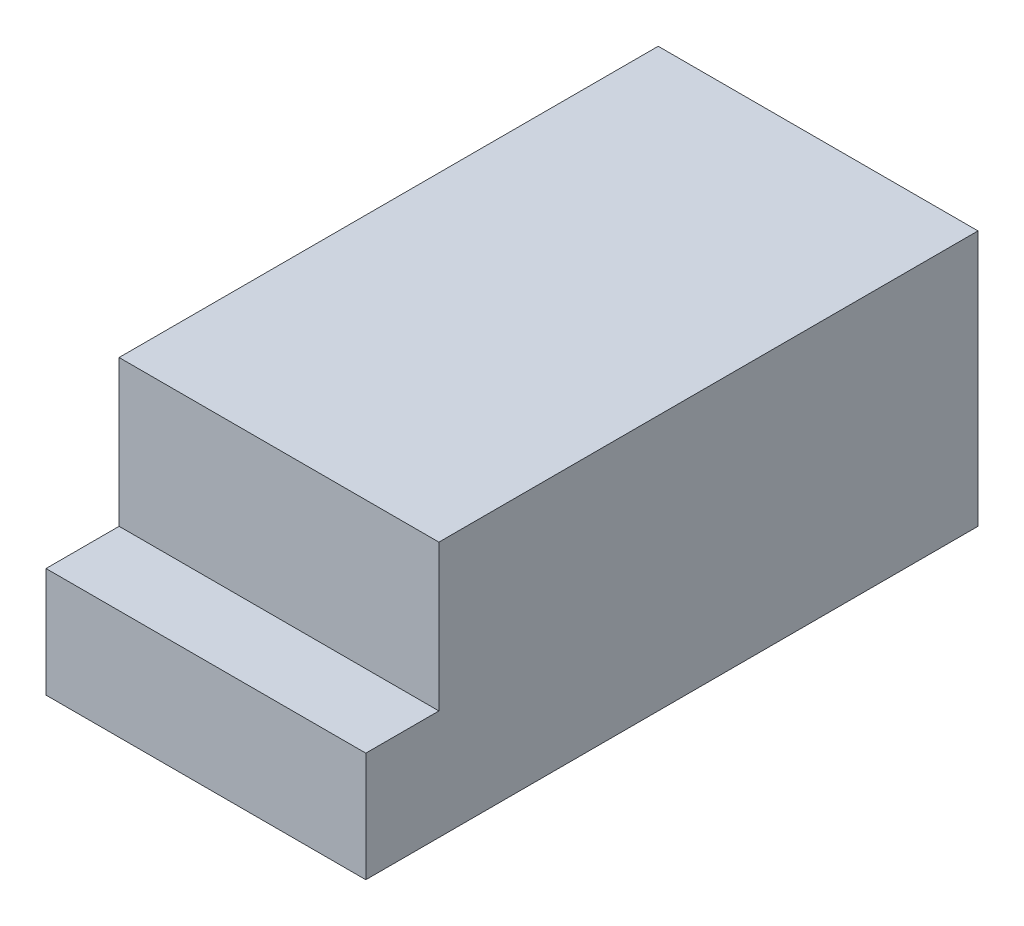
ISO-10303-21;
HEADER;
FILE_DESCRIPTION(('STEP AP214'),'2;1');
FILE_NAME('part.step','',(''),(''),'','','');
FILE_SCHEMA(('AUTOMOTIVE_DESIGN { 1 0 10303 214 1 1 1 1 }'));
ENDSEC;
DATA;
#1=APPLICATION_CONTEXT('core data for automotive mechanical design processes');
#2=APPLICATION_PROTOCOL_DEFINITION('international standard','automotive_design',2000,#1);
#3=PRODUCT_CONTEXT('',#1,'mechanical');
#4=PRODUCT('Part','Part','',(#3));
#5=PRODUCT_RELATED_PRODUCT_CATEGORY('part','',(#4));
#6=PRODUCT_DEFINITION_FORMATION('','',#4);
#7=PRODUCT_DEFINITION_CONTEXT('part definition',#1,'design');
#8=PRODUCT_DEFINITION('design','',#6,#7);
#9=PRODUCT_DEFINITION_SHAPE('','',#8);
#10=(LENGTH_UNIT() NAMED_UNIT(*) SI_UNIT(.MILLI.,.METRE.));
#11=(NAMED_UNIT(*) PLANE_ANGLE_UNIT() SI_UNIT($,.RADIAN.));
#12=(NAMED_UNIT(*) SI_UNIT($,.STERADIAN.) SOLID_ANGLE_UNIT());
#13=UNCERTAINTY_MEASURE_WITH_UNIT(LENGTH_MEASURE(1.E-05),#10,'distance_accuracy_value','');
#14=(GEOMETRIC_REPRESENTATION_CONTEXT(3) GLOBAL_UNCERTAINTY_ASSIGNED_CONTEXT((#13)) GLOBAL_UNIT_ASSIGNED_CONTEXT((#10,
#11,#12)) REPRESENTATION_CONTEXT('',''));
#15=CARTESIAN_POINT('',(0.,0.,0.));
#16=DIRECTION('',(0.,0.,1.));
#17=DIRECTION('',(1.,0.,0.));
#18=AXIS2_PLACEMENT_3D('',#15,#16,#17);
#19=CARTESIAN_POINT('',(55.5625,44.45,212.725));
#20=DIRECTION('',(0.,-1.,0.));
#21=DIRECTION('',(1.,0.,0.));
#22=AXIS2_PLACEMENT_3D('',#19,#20,#21);
#23=PLANE('',#22);
#24=DIRECTION('',(-1.,0.,0.));
#25=VECTOR('',#24,1.);
#26=CARTESIAN_POINT('',(-55.5625,44.45,187.325));
#27=LINE('',#26,#25);
#28=CARTESIAN_POINT('',(55.5625,44.45,187.325));
#29=VERTEX_POINT('',#28);
#30=CARTESIAN_POINT('',(-55.5625,44.45,187.325));
#31=VERTEX_POINT('',#30);
#32=EDGE_CURVE('E144',#29,#31,#27,.T.);
#33=ORIENTED_EDGE('',*,*,#32,.F.);
#34=DIRECTION('',(0.,0.,-1.));
#35=VECTOR('',#34,1.);
#36=CARTESIAN_POINT('',(55.5625,44.45,212.725));
#37=LINE('',#36,#35);
#38=CARTESIAN_POINT('',(55.5625,44.45,0.));
#39=VERTEX_POINT('',#38);
#40=EDGE_CURVE('E101',#29,#39,#37,.T.);
#41=ORIENTED_EDGE('',*,*,#40,.T.);
#42=DIRECTION('',(-1.,0.,0.));
#43=VECTOR('',#42,1.);
#44=CARTESIAN_POINT('',(55.5625,44.45,0.));
#45=LINE('',#44,#43);
#46=CARTESIAN_POINT('',(-55.5625,44.45,0.));
#47=VERTEX_POINT('',#46);
#48=EDGE_CURVE('E105',#39,#47,#45,.T.);
#49=ORIENTED_EDGE('',*,*,#48,.T.);
#50=DIRECTION('',(0.,0.,-1.));
#51=VECTOR('',#50,1.);
#52=CARTESIAN_POINT('',(-55.5625,44.45,212.725));
#53=LINE('',#52,#51);
#54=EDGE_CURVE('E90',#31,#47,#53,.T.);
#55=ORIENTED_EDGE('',*,*,#54,.F.);
#56=EDGE_LOOP('',(#33,#41,#49,#55));
#57=FACE_BOUND('',#56,.T.);
#58=ADVANCED_FACE('F45',(#57),#23,.F.);
#59=CARTESIAN_POINT('',(-55.5625,-44.45,212.725));
#60=DIRECTION('',(1.,0.,0.));
#61=DIRECTION('',(0.,0.,-1.));
#62=AXIS2_PLACEMENT_3D('',#59,#60,#61);
#63=PLANE('',#62);
#64=DIRECTION('',(0.,-1.,0.));
#65=VECTOR('',#64,1.);
#66=CARTESIAN_POINT('',(-55.5625,-44.45,212.725));
#67=LINE('',#66,#65);
#68=CARTESIAN_POINT('',(-55.5625,-6.35000000000002,212.725));
#69=VERTEX_POINT('',#68);
#70=CARTESIAN_POINT('',(-55.5625,-44.45,212.725));
#71=VERTEX_POINT('',#70);
#72=EDGE_CURVE('E111',#69,#71,#67,.T.);
#73=ORIENTED_EDGE('',*,*,#72,.F.);
#74=DIRECTION('',(0.,0.,1.));
#75=VECTOR('',#74,1.);
#76=CARTESIAN_POINT('',(-55.5625,-6.35000000000002,187.325));
#77=LINE('',#76,#75);
#78=CARTESIAN_POINT('',(-55.5625,-6.35000000000002,187.325));
#79=VERTEX_POINT('',#78);
#80=EDGE_CURVE('E61',#79,#69,#77,.T.);
#81=ORIENTED_EDGE('',*,*,#80,.F.);
#82=DIRECTION('',(0.,-1.,0.));
#83=VECTOR('',#82,1.);
#84=CARTESIAN_POINT('',(-55.5625,44.45,187.325));
#85=LINE('',#84,#83);
#86=EDGE_CURVE('E97',#31,#79,#85,.T.);
#87=ORIENTED_EDGE('',*,*,#86,.F.);
#88=ORIENTED_EDGE('',*,*,#54,.T.);
#89=DIRECTION('',(0.,-1.,0.));
#90=VECTOR('',#89,1.);
#91=CARTESIAN_POINT('',(-55.5625,-44.45,0.));
#92=LINE('',#91,#90);
#93=CARTESIAN_POINT('',(-55.5625,-44.45,0.));
#94=VERTEX_POINT('',#93);
#95=EDGE_CURVE('E95',#47,#94,#92,.T.);
#96=ORIENTED_EDGE('',*,*,#95,.T.);
#97=DIRECTION('',(0.,0.,-1.));
#98=VECTOR('',#97,1.);
#99=CARTESIAN_POINT('',(-55.5625,-44.45,212.725));
#100=LINE('',#99,#98);
#101=EDGE_CURVE('E11',#71,#94,#100,.T.);
#102=ORIENTED_EDGE('',*,*,#101,.F.);
#103=EDGE_LOOP('',(#73,#81,#87,#88,#96,#102));
#104=FACE_BOUND('',#103,.T.);
#105=ADVANCED_FACE('F47',(#104),#63,.F.);
#106=CARTESIAN_POINT('',(55.5625,-44.45,212.725));
#107=DIRECTION('',(0.,1.,0.));
#108=DIRECTION('',(-1.,0.,0.));
#109=AXIS2_PLACEMENT_3D('',#106,#107,#108);
#110=PLANE('',#109);
#111=DIRECTION('',(1.,0.,0.));
#112=VECTOR('',#111,1.);
#113=CARTESIAN_POINT('',(55.5625,-44.45,0.));
#114=LINE('',#113,#112);
#115=CARTESIAN_POINT('',(55.5625,-44.45,0.));
#116=VERTEX_POINT('',#115);
#117=EDGE_CURVE('E115',#94,#116,#114,.T.);
#118=ORIENTED_EDGE('',*,*,#117,.T.);
#119=DIRECTION('',(0.,0.,-1.));
#120=VECTOR('',#119,1.);
#121=CARTESIAN_POINT('',(55.5625,-44.45,212.725));
#122=LINE('',#121,#120);
#123=CARTESIAN_POINT('',(55.5625,-44.45,212.725));
#124=VERTEX_POINT('',#123);
#125=EDGE_CURVE('E54',#124,#116,#122,.T.);
#126=ORIENTED_EDGE('',*,*,#125,.F.);
#127=DIRECTION('',(1.,0.,0.));
#128=VECTOR('',#127,1.);
#129=CARTESIAN_POINT('',(55.5625,-44.45,212.725));
#130=LINE('',#129,#128);
#131=EDGE_CURVE('E70',#71,#124,#130,.T.);
#132=ORIENTED_EDGE('',*,*,#131,.F.);
#133=ORIENTED_EDGE('',*,*,#101,.T.);
#134=EDGE_LOOP('',(#118,#126,#132,#133));
#135=FACE_BOUND('',#134,.T.);
#136=ADVANCED_FACE('F137',(#135),#110,.F.);
#137=CARTESIAN_POINT('',(55.5625,-44.45,212.725));
#138=DIRECTION('',(-1.,0.,0.));
#139=DIRECTION('',(0.,0.,1.));
#140=AXIS2_PLACEMENT_3D('',#137,#138,#139);
#141=PLANE('',#140);
#142=DIRECTION('',(0.,1.,0.));
#143=VECTOR('',#142,1.);
#144=CARTESIAN_POINT('',(55.5625,44.45,187.325));
#145=LINE('',#144,#143);
#146=CARTESIAN_POINT('',(55.5625,-6.35000000000002,187.325));
#147=VERTEX_POINT('',#146);
#148=EDGE_CURVE('E152',#147,#29,#145,.T.);
#149=ORIENTED_EDGE('',*,*,#148,.F.);
#150=DIRECTION('',(0.,0.,1.));
#151=VECTOR('',#150,1.);
#152=CARTESIAN_POINT('',(55.5625,-6.35000000000002,187.325));
#153=LINE('',#152,#151);
#154=CARTESIAN_POINT('',(55.5625,-6.35000000000002,212.725));
#155=VERTEX_POINT('',#154);
#156=EDGE_CURVE('E117',#147,#155,#153,.T.);
#157=ORIENTED_EDGE('',*,*,#156,.T.);
#158=DIRECTION('',(0.,1.,0.));
#159=VECTOR('',#158,1.);
#160=CARTESIAN_POINT('',(55.5625,-44.45,212.725));
#161=LINE('',#160,#159);
#162=EDGE_CURVE('E102',#124,#155,#161,.T.);
#163=ORIENTED_EDGE('',*,*,#162,.F.);
#164=ORIENTED_EDGE('',*,*,#125,.T.);
#165=DIRECTION('',(0.,1.,0.));
#166=VECTOR('',#165,1.);
#167=CARTESIAN_POINT('',(55.5625,-44.45,0.));
#168=LINE('',#167,#166);
#169=EDGE_CURVE('E112',#116,#39,#168,.T.);
#170=ORIENTED_EDGE('',*,*,#169,.T.);
#171=ORIENTED_EDGE('',*,*,#40,.F.);
#172=EDGE_LOOP('',(#149,#157,#163,#164,#170,#171));
#173=FACE_BOUND('',#172,.T.);
#174=ADVANCED_FACE('F135',(#173),#141,.F.);
#175=CARTESIAN_POINT('',(0.,0.,212.725));
#176=DIRECTION('',(0.,0.,1.));
#177=DIRECTION('',(1.,0.,0.));
#178=AXIS2_PLACEMENT_3D('',#175,#176,#177);
#179=PLANE('',#178);
#180=DIRECTION('',(1.,0.,0.));
#181=VECTOR('',#180,1.);
#182=CARTESIAN_POINT('',(-55.5625,-6.35000000000002,212.725));
#183=LINE('',#182,#181);
#184=EDGE_CURVE('E146',#69,#155,#183,.T.);
#185=ORIENTED_EDGE('',*,*,#184,.F.);
#186=ORIENTED_EDGE('',*,*,#72,.T.);
#187=ORIENTED_EDGE('',*,*,#131,.T.);
#188=ORIENTED_EDGE('',*,*,#162,.T.);
#189=EDGE_LOOP('',(#185,#186,#187,#188));
#190=FACE_BOUND('',#189,.T.);
#191=ADVANCED_FACE('F171',(#190),#179,.T.);
#192=CARTESIAN_POINT('',(0.,0.,0.));
#193=DIRECTION('',(0.,0.,1.));
#194=DIRECTION('',(1.,0.,0.));
#195=AXIS2_PLACEMENT_3D('',#192,#193,#194);
#196=PLANE('',#195);
#197=ORIENTED_EDGE('',*,*,#95,.F.);
#198=ORIENTED_EDGE('',*,*,#48,.F.);
#199=ORIENTED_EDGE('',*,*,#169,.F.);
#200=ORIENTED_EDGE('',*,*,#117,.F.);
#201=EDGE_LOOP('',(#197,#198,#199,#200));
#202=FACE_BOUND('',#201,.T.);
#203=ADVANCED_FACE('F114',(#202),#196,.F.);
#204=CARTESIAN_POINT('',(-55.5625,-6.35000000000002,187.325));
#205=DIRECTION('',(0.,-1.,0.));
#206=DIRECTION('',(0.,0.,-1.));
#207=AXIS2_PLACEMENT_3D('',#204,#205,#206);
#208=PLANE('',#207);
#209=ORIENTED_EDGE('',*,*,#184,.T.);
#210=ORIENTED_EDGE('',*,*,#156,.F.);
#211=DIRECTION('',(1.,0.,0.));
#212=VECTOR('',#211,1.);
#213=CARTESIAN_POINT('',(-55.5625,-6.35000000000002,187.325));
#214=LINE('',#213,#212);
#215=EDGE_CURVE('E156',#79,#147,#214,.T.);
#216=ORIENTED_EDGE('',*,*,#215,.F.);
#217=ORIENTED_EDGE('',*,*,#80,.T.);
#218=EDGE_LOOP('',(#209,#210,#216,#217));
#219=FACE_BOUND('',#218,.T.);
#220=ADVANCED_FACE('F173',(#219),#208,.F.);
#221=CARTESIAN_POINT('',(0.,0.,187.325));
#222=DIRECTION('',(0.,0.,1.));
#223=DIRECTION('',(1.,0.,0.));
#224=AXIS2_PLACEMENT_3D('',#221,#222,#223);
#225=PLANE('',#224);
#226=ORIENTED_EDGE('',*,*,#86,.T.);
#227=ORIENTED_EDGE('',*,*,#215,.T.);
#228=ORIENTED_EDGE('',*,*,#148,.T.);
#229=ORIENTED_EDGE('',*,*,#32,.T.);
#230=EDGE_LOOP('',(#226,#227,#228,#229));
#231=FACE_BOUND('',#230,.T.);
#232=ADVANCED_FACE('F162',(#231),#225,.T.);
#233=CLOSED_SHELL('',(#58,#105,#136,#174,#191,#203,#220,#232));
#234=MANIFOLD_SOLID_BREP('B2',#233);
#235=ADVANCED_BREP_SHAPE_REPRESENTATION('',(#18,#234),#14);
#236=SHAPE_DEFINITION_REPRESENTATION(#9,#235);
ENDSEC;
END-ISO-10303-21;
